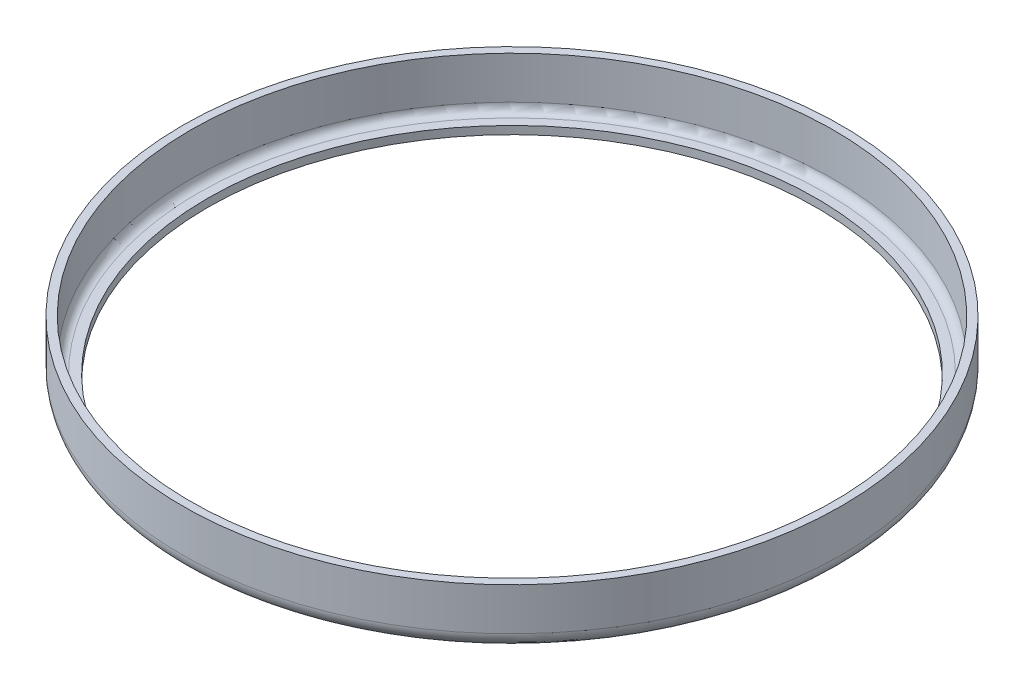
ISO-10303-21;
HEADER;
FILE_DESCRIPTION(('STEP AP214'),'2;1');
FILE_NAME('part.step','',(''),(''),'','','');
FILE_SCHEMA(('AUTOMOTIVE_DESIGN { 1 0 10303 214 1 1 1 1 }'));
ENDSEC;
DATA;
#1=APPLICATION_CONTEXT('core data for automotive mechanical design processes');
#2=APPLICATION_PROTOCOL_DEFINITION('international standard','automotive_design',2000,#1);
#3=PRODUCT_CONTEXT('',#1,'mechanical');
#4=PRODUCT('Part','Part','',(#3));
#5=PRODUCT_RELATED_PRODUCT_CATEGORY('part','',(#4));
#6=PRODUCT_DEFINITION_FORMATION('','',#4);
#7=PRODUCT_DEFINITION_CONTEXT('part definition',#1,'design');
#8=PRODUCT_DEFINITION('design','',#6,#7);
#9=PRODUCT_DEFINITION_SHAPE('','',#8);
#10=(LENGTH_UNIT() NAMED_UNIT(*) SI_UNIT(.MILLI.,.METRE.));
#11=(NAMED_UNIT(*) PLANE_ANGLE_UNIT() SI_UNIT($,.RADIAN.));
#12=(NAMED_UNIT(*) SI_UNIT($,.STERADIAN.) SOLID_ANGLE_UNIT());
#13=UNCERTAINTY_MEASURE_WITH_UNIT(LENGTH_MEASURE(1.E-05),#10,'distance_accuracy_value','');
#14=(GEOMETRIC_REPRESENTATION_CONTEXT(3) GLOBAL_UNCERTAINTY_ASSIGNED_CONTEXT((#13)) GLOBAL_UNIT_ASSIGNED_CONTEXT((#10,
#11,#12)) REPRESENTATION_CONTEXT('',''));
#15=CARTESIAN_POINT('',(0.,0.,0.));
#16=DIRECTION('',(0.,0.,1.));
#17=DIRECTION('',(1.,0.,0.));
#18=AXIS2_PLACEMENT_3D('',#15,#16,#17);
#19=CARTESIAN_POINT('',(0.,1.3,0.));
#20=DIRECTION('',(0.,1.,0.));
#21=DIRECTION('',(-1.,0.,0.));
#22=AXIS2_PLACEMENT_3D('',#19,#20,#21);
#23=PLANE('',#22);
#24=CARTESIAN_POINT('',(0.,1.3,0.));
#25=DIRECTION('',(0.,1.,0.));
#26=DIRECTION('',(-1.,0.,0.));
#27=AXIS2_PLACEMENT_3D('',#24,#25,#26);
#28=CIRCLE('',#27,49.5);
#29=CARTESIAN_POINT('',(-49.5,1.3,0.));
#30=VERTEX_POINT('',#29);
#31=EDGE_CURVE('E53',#30,#30,#28,.F.);
#32=ORIENTED_EDGE('',*,*,#31,.T.);
#33=EDGE_LOOP('',(#32));
#34=FACE_BOUND('',#33,.T.);
#35=CARTESIAN_POINT('',(0.,1.3,0.));
#36=DIRECTION('',(0.,-1.,0.));
#37=DIRECTION('',(-1.,0.,0.));
#38=AXIS2_PLACEMENT_3D('',#35,#36,#37);
#39=CIRCLE('',#38,51.);
#40=CARTESIAN_POINT('',(51.,1.3,0.));
#41=VERTEX_POINT('',#40);
#42=CARTESIAN_POINT('',(-51.,1.3,0.));
#43=VERTEX_POINT('',#42);
#44=EDGE_CURVE('E51',#41,#43,#39,.F.);
#45=ORIENTED_EDGE('',*,*,#44,.T.);
#46=CARTESIAN_POINT('',(51.,1.3,0.));
#47=CARTESIAN_POINT('',(51.0000048953473,1.30000000000007,0.380232623310823));
#48=CARTESIAN_POINT('',(50.995755911983,1.30000000001969,0.760465264724093));
#49=CARTESIAN_POINT('',(50.9787540292217,1.3000000000918,1.52081383077974));
#50=CARTESIAN_POINT('',(50.96599948816,1.30000000014428,1.90092971871491));
#51=CARTESIAN_POINT('',(50.9319870512731,1.30000000027584,2.66085438904016));
#52=CARTESIAN_POINT('',(50.9107275146425,1.30000000035492,3.04066309799282));
#53=CARTESIAN_POINT('',(50.8597110518025,1.30000000053392,3.79978301740181));
#54=CARTESIAN_POINT('',(50.8299524866894,1.30000000063384,4.17909411771625));
#55=CARTESIAN_POINT('',(50.7619478933905,1.30000000084911,4.93702848590818));
#56=CARTESIAN_POINT('',(50.7237002289656,1.30000000096446,5.31565160697719));
#57=CARTESIAN_POINT('',(50.6387317130363,1.30000000120557,6.07201984610875));
#58=CARTESIAN_POINT('',(50.5920092287945,1.30000000133133,6.44976478075419));
#59=CARTESIAN_POINT('',(50.4901095934652,1.30000000158865,7.20418673328524));
#60=CARTESIAN_POINT('',(50.4349308139578,1.3000000017202,7.58086353122108));
#61=CARTESIAN_POINT('',(50.3161413768466,1.30000000198485,8.33295964982566));
#62=CARTESIAN_POINT('',(50.2525290959601,1.30000000211794,8.70837871410645));
#63=CARTESIAN_POINT('',(50.1168997001863,1.30000000238181,9.45777025376751));
#64=CARTESIAN_POINT('',(50.0448809679699,1.30000000251259,9.83174243643444));
#65=CARTESIAN_POINT('',(49.8924699631129,1.30000000276836,10.5780516458877));
#66=CARTESIAN_POINT('',(49.8120760799114,1.30000000289336,10.9503883437665));
#67=CARTESIAN_POINT('',(49.6429503055862,1.30000000313447,11.6932386569306));
#68=CARTESIAN_POINT('',(49.5542168114815,1.30000000325059,12.0637519072637));
#69=CARTESIAN_POINT('',(49.3684515747464,1.30000000347125,12.8027681343629));
#70=CARTESIAN_POINT('',(49.2714182375233,1.3000000035758,13.1712707102996));
#71=CARTESIAN_POINT('',(49.0690972864767,1.300000003771,13.906079228634));
#72=CARTESIAN_POINT('',(48.9638080872537,1.30000000386166,14.272384734511));
#73=CARTESIAN_POINT('',(48.7450235801929,1.30000000402716,15.0026136787638));
#74=CARTESIAN_POINT('',(48.63152669695,1.300000004102,15.3665366451317));
#75=CARTESIAN_POINT('',(48.396379167268,1.30000000423432,16.0918160971199));
#76=CARTESIAN_POINT('',(48.2747269562148,1.3000000042918,16.4531720754671));
#77=CARTESIAN_POINT('',(48.0233252729979,1.30000000438824,17.1731342532365));
#78=CARTESIAN_POINT('',(47.8935742478029,1.30000000442721,17.5317399103605));
#79=CARTESIAN_POINT('',(47.6260355721526,1.30000000448584,18.24601935653));
#80=CARTESIAN_POINT('',(47.4882463810354,1.30000000450552,18.6016925685098));
#81=CARTESIAN_POINT('',(47.2046961181244,1.30000000452519,19.3099263377657));
#82=CARTESIAN_POINT('',(47.0589335188191,1.30000000452519,19.6624862834841));
#83=CARTESIAN_POINT('',(46.7595052656968,1.30000000450552,20.3643141291298));
#84=CARTESIAN_POINT('',(46.605838098294,1.30000000448584,20.7135813833005));
#85=CARTESIAN_POINT('',(46.2906735874604,1.3000000044272,21.4086459427637));
#86=CARTESIAN_POINT('',(46.129174745138,1.30000000438824,21.7544425684114));
#87=CARTESIAN_POINT('',(45.7984237839034,1.30000000429179,22.4423895476132));
#88=CARTESIAN_POINT('',(45.6291701815558,1.30000000423431,22.7845391879622));
#89=CARTESIAN_POINT('',(45.2829905872107,1.30000000410199,23.465017544452));
#90=CARTESIAN_POINT('',(45.1060631279886,1.30000000402714,23.8033455141727));
#91=CARTESIAN_POINT('',(44.7446206588051,1.30000000386164,24.476007638933));
#92=CARTESIAN_POINT('',(44.5601041985772,1.30000000377098,24.8103410146996));
#93=CARTESIAN_POINT('',(44.1835724806722,1.30000000357578,25.474842912528));
#94=CARTESIAN_POINT('',(43.991555790426,1.30000000347123,25.805010622843));
#95=CARTESIAN_POINT('',(43.6001162405039,1.30000000325057,26.4610120912074));
#96=CARTESIAN_POINT('',(43.400691966687,1.30000000313445,26.786845005432));
#97=CARTESIAN_POINT('',(42.9945337107304,1.30000000289333,27.4340098117407));
#98=CARTESIAN_POINT('',(42.7877983335999,1.30000000276834,27.7553408283345));
#99=CARTESIAN_POINT('',(42.3671181213991,1.30000000251257,28.3933368853933));
#100=CARTESIAN_POINT('',(42.1531719112014,1.30000000238179,28.7100010191311));
#101=CARTESIAN_POINT('',(41.7181740272876,1.30000000211792,29.3385005591991));
#102=CARTESIAN_POINT('',(41.497120999011,1.30000000198482,29.6503350280102));
#103=CARTESIAN_POINT('',(41.0480171680534,1.30000000172018,30.2690147734741));
#104=CARTESIAN_POINT('',(40.8199650320724,1.30000000158864,30.5758590822761));
#105=CARTESIAN_POINT('',(40.3569743261539,1.3000000013313,31.1844004199057));
#106=CARTESIAN_POINT('',(40.1220344448612,1.3000000012055,31.4860964510284));
#107=CARTESIAN_POINT('',(39.6453831651447,1.30000000096449,32.0841855833832));
#108=CARTESIAN_POINT('',(39.4036704779801,1.30000000084928,32.3805776575451));
#109=CARTESIAN_POINT('',(38.9135921135736,1.30000000063363,32.9679058297759));
#110=CARTESIAN_POINT('',(38.6652251708807,1.3000000005332,33.258840871929));
#111=CARTESIAN_POINT('',(38.1619600513174,1.30000000035562,33.8351043067912));
#112=CARTESIAN_POINT('',(37.9070606328874,1.30000000027848,34.1204316152143));
#113=CARTESIAN_POINT('',(37.3908567064004,1.30000000014162,34.6853325266122));
#114=CARTESIAN_POINT('',(37.1295509814981,1.30000000008191,34.9649050176437));
#115=CARTESIAN_POINT('',(36.6006603728143,1.30000000002958,35.5181485867249));
#116=CARTESIAN_POINT('',(36.3330742968432,1.30000000003698,35.7918185250694));
#117=CARTESIAN_POINT('',(35.792678960063,1.29999999996314,36.3322115838563));
#118=CARTESIAN_POINT('',(35.5198890399218,1.29999999988218,36.5989540465107));
#119=CARTESIAN_POINT('',(34.9684120981636,1.30000000047375,37.1262667336179));
#120=CARTESIAN_POINT('',(34.6897251338751,1.30000000114627,37.3868370180217));
#121=CARTESIAN_POINT('',(34.1265925188405,1.30000000828848,37.9016721321756));
#122=CARTESIAN_POINT('',(33.842146916405,1.30000001475813,38.1559370147833));
#123=CARTESIAN_POINT('',(33.2676336433653,1.3000000403726,38.6580368453349));
#124=CARTESIAN_POINT('',(32.9775660124357,1.30000005951733,38.9058718386257));
#125=CARTESIAN_POINT('',(32.5749711243778,1.3000001059059,39.2421372724497));
#126=CARTESIAN_POINT('',(32.4647878435351,1.30000012060955,39.3333857931299));
#127=CARTESIAN_POINT('',(32.1699487210445,1.30000016101675,39.5754656337379));
#128=CARTESIAN_POINT('',(31.9846107209607,1.30000018751909,39.7254674626692));
#129=CARTESIAN_POINT('',(31.5000063298855,1.30000023888953,40.1120409400474));
#130=CARTESIAN_POINT('',(31.1990983988414,1.30000025323814,40.3465591494784));
#131=CARTESIAN_POINT('',(30.592066473726,1.30000024176809,40.8087194195124));
#132=CARTESIAN_POINT('',(30.2859426424976,1.30000021595068,41.0363616941724));
#133=CARTESIAN_POINT('',(29.6686522730677,1.30000013805286,41.4846861110306));
#134=CARTESIAN_POINT('',(29.3574859112223,1.30000008597335,41.7053684958502));
#135=CARTESIAN_POINT('',(28.8086070691199,1.30000002406076,42.0852713355504));
#136=CARTESIAN_POINT('',(28.5719805079041,1.30000000692075,42.2460637359944));
#137=CARTESIAN_POINT('',(28.0815311708759,1.299999992653,42.5736224797916));
#138=CARTESIAN_POINT('',(27.8275468780452,1.29999999682283,42.7401468249868));
#139=CARTESIAN_POINT('',(27.1247071788344,1.3000000094836,43.1920099421992));
#140=CARTESIAN_POINT('',(26.6727992749554,1.30000001886741,43.472624457845));
#141=CARTESIAN_POINT('',(25.8373755655962,1.30000005827419,43.9734668032524));
#142=CARTESIAN_POINT('',(25.4551768835146,1.30000008455006,44.195898229002));
#143=CARTESIAN_POINT('',(24.7293748413681,1.30000012114485,44.6057025717932));
#144=CARTESIAN_POINT('',(24.3863872415922,1.30000013295126,44.794165677721));
#145=CARTESIAN_POINT('',(23.7468980640556,1.30000013816059,45.1359871689574));
#146=CARTESIAN_POINT('',(23.4509767310044,1.30000013401427,45.2904326752634));
#147=CARTESIAN_POINT('',(22.8136674692769,1.30000011905218,45.615117221889));
#148=CARTESIAN_POINT('',(22.4718228254377,1.30000010736834,45.7844610383661));
#149=CARTESIAN_POINT('',(21.7844149524757,1.30000007856829,46.1154084448778));
#150=CARTESIAN_POINT('',(21.4388517703319,1.30000006145215,46.2770121325592));
#151=CARTESIAN_POINT('',(20.7441857596195,1.30000002940441,46.5924207569242));
#152=CARTESIAN_POINT('',(20.3950829802787,1.30000001447277,46.7462258018912));
#153=CARTESIAN_POINT('',(19.8688903310319,1.30000000263213,46.9709678263064));
#154=CARTESIAN_POINT('',(19.6930692936616,1.30000000044473,47.0448877405375));
#155=CARTESIAN_POINT('',(19.4441896464366,1.2999999998166,47.14794611826));
#156=CARTESIAN_POINT('',(19.3714573778855,1.29999999992955,47.177874277735));
#157=CARTESIAN_POINT('',(18.9682018343392,1.3000000004758,47.3427343001128));
#158=CARTESIAN_POINT('',(18.636342986937,1.30000000062826,47.4744176352239));
#159=CARTESIAN_POINT('',(17.9298893857385,1.3000000112775,47.746186431155));
#160=CARTESIAN_POINT('',(17.5549509911742,1.30000002301506,47.8853801998617));
#161=CARTESIAN_POINT('',(17.0491026914815,1.3000000463518,48.0664377348183));
#162=CARTESIAN_POINT('',(16.9195800040398,1.30000005298326,48.1122084582486));
#163=CARTESIAN_POINT('',(16.4135202378357,1.30000007960458,48.288737128996));
#164=CARTESIAN_POINT('',(16.0356117392959,1.30000010101759,48.415600994342));
#165=CARTESIAN_POINT('',(15.3731091344217,1.30000012648927,48.6293594906958));
#166=CARTESIAN_POINT('',(15.0891492296108,1.30000013357149,48.7182327370458));
#167=CARTESIAN_POINT('',(14.3937588859858,1.3000001389228,48.9291855569175));
#168=CARTESIAN_POINT('',(13.9815044236233,1.30000013190771,49.0485641265525));
#169=CARTESIAN_POINT('',(13.2000828802515,1.30000011059789,49.2641649693778));
#170=CARTESIAN_POINT('',(12.8312181643637,1.30000009719868,49.3614863346895));
#171=CARTESIAN_POINT('',(12.0914026404646,1.30000006609533,49.5478203829288));
#172=CARTESIAN_POINT('',(11.7204518595016,1.30000004839125,49.6368331733246));
#173=CARTESIAN_POINT('',(10.8836498443703,1.30000001560988,49.8276350984469));
#174=CARTESIAN_POINT('',(10.4172547554729,1.3000000022954,49.9270561287467));
#175=CARTESIAN_POINT('',(9.80941312730236,1.29999999931187,50.047927127405));
#176=CARTESIAN_POINT('',(9.66910720238991,1.29999999961404,50.0752272813076));
#177=CARTESIAN_POINT('',(9.11257964542098,1.30000000119027,50.1811095335631));
#178=CARTESIAN_POINT('',(8.69547640814306,1.30000000320779,50.2551421365711));
#179=CARTESIAN_POINT('',(8.0120480497792,1.30000001931494,50.3676790460049));
#180=CARTESIAN_POINT('',(7.74622808779641,1.30000002873206,50.4092917286622));
#181=CARTESIAN_POINT('',(7.23985127965558,1.3000000509044,50.4844613212091));
#182=CARTESIAN_POINT('',(6.99935230387441,1.30000006324579,50.5184080994219));
#183=CARTESIAN_POINT('',(6.37902396432565,1.30000009473289,50.6014398619699));
#184=CARTESIAN_POINT('',(5.99884738598455,1.30000011369708,50.6479616662348));
#185=CARTESIAN_POINT('',(5.41181983914117,1.30000013093695,50.7130639471458));
#186=CARTESIAN_POINT('',(5.20530082658009,1.30000013470935,50.7346856589061));
#187=CARTESIAN_POINT('',(4.85629517127227,1.30000013648819,50.7690616518881));
#188=CARTESIAN_POINT('',(4.71387388834404,1.30000013592322,50.7824820960553));
#189=CARTESIAN_POINT('',(4.19146963898923,1.30000013159216,50.8294873092577));
#190=CARTESIAN_POINT('',(3.81114897425805,1.30000012406033,50.8594019566085));
#191=CARTESIAN_POINT('',(3.04994010328053,1.30000010132014,50.9106638980825));
#192=CARTESIAN_POINT('',(2.66905190389029,1.30000008611187,50.9320112948735));
#193=CARTESIAN_POINT('',(1.90689541399431,1.30000005333878,50.9661458217748));
#194=CARTESIAN_POINT('',(1.52562712859314,1.300000035774,50.9789330653377));
#195=CARTESIAN_POINT('',(0.76290569260361,1.30000001052997,50.9958810772168));
#196=CARTESIAN_POINT('',(0.381452544780571,1.30000000285057,51.0000419708178));
#197=CARTESIAN_POINT('',(-0.381507426537838,1.29999999714902,50.9999580231437));
#198=CARTESIAN_POINT('',(-0.76301424985967,1.29999999912825,50.9957119724014));
#199=CARTESIAN_POINT('',(-1.52583357765886,1.30000000122794,50.978647330571));
#200=CARTESIAN_POINT('',(-1.90714608398824,1.30000000134843,50.965828822776));
#201=CARTESIAN_POINT('',(-2.66938441111839,1.30000000808823,50.9316714338143));
#202=CARTESIAN_POINT('',(-3.0503102351347,1.30000001470749,50.9103326240917));
#203=CARTESIAN_POINT('',(-3.81159065259163,1.30000004042726,50.8591301196185));
#204=CARTESIAN_POINT('',(-4.19194525004263,1.30000005952769,50.8292664850013));
#205=CARTESIAN_POINT('',(-4.71439839531572,1.30000010590387,50.7823643103975));
#206=CARTESIAN_POINT('',(-4.85683218805472,1.3000001206091,50.7689754416163));
#207=CARTESIAN_POINT('',(-5.23649122711217,1.30000016101754,50.7316690320348));
#208=CARTESIAN_POINT('',(-5.4736122937344,1.30000018751756,50.7066825671865));
#209=CARTESIAN_POINT('',(-6.08962807102455,1.30000023888389,50.6373642184646));
#210=CARTESIAN_POINT('',(-6.46823152510104,1.30000025323188,50.5904196039376));
#211=CARTESIAN_POINT('',(-7.22426457588123,1.30000024176136,50.4879798795669));
#212=CARTESIAN_POINT('',(-7.60169420879789,1.3000002159441,50.4324850362257));
#213=CARTESIAN_POINT('',(-8.35519765050508,1.30000013804814,50.3130080646163));
#214=CARTESIAN_POINT('',(-8.73127150615117,1.30000008597035,50.2490262326027));
#215=CARTESIAN_POINT('',(-9.38801933299349,1.30000002405989,50.129542160623));
#216=CARTESIAN_POINT('',(-9.66903697668018,1.30000000692051,50.0759193141914));
#217=CARTESIAN_POINT('',(-10.2474564899152,1.29999999265325,49.9607381834231));
#218=CARTESIAN_POINT('',(-10.5448014491279,1.29999999682291,49.8988945628613));
#219=CARTESIAN_POINT('',(-11.361299635701,1.30000000948346,49.7214272966977));
#220=CARTESIAN_POINT('',(-11.8792707557527,1.30000001886738,49.6003046787091));
#221=CARTESIAN_POINT('',(-12.8241529428579,1.3000000582742,49.3637200783747));
#222=CARTESIAN_POINT('',(-13.2516908381993,1.30000008455003,49.2507476107567));
#223=CARTESIAN_POINT('',(-14.0546858157801,1.30000012114479,49.0273035022023));
#224=CARTESIAN_POINT('',(-14.4304783675745,1.30000013295119,48.9180381419079));
#225=CARTESIAN_POINT('',(-15.1243699488235,1.30000013816053,48.707555256026));
#226=CARTESIAN_POINT('',(-15.4428273950125,1.30000013401422,48.6075167395638));
#227=CARTESIAN_POINT('',(-16.1230597404833,1.30000011905214,48.3864576835459));
#228=CARTESIAN_POINT('',(-16.4845245673041,1.30000010736831,48.2644811787504));
#229=CARTESIAN_POINT('',(-17.2046104912091,1.30000007856827,48.0124255656776));
#230=CARTESIAN_POINT('',(-17.5632316241206,1.30000006145214,47.8823465596663));
#231=CARTESIAN_POINT('',(-18.2774622482221,1.30000002940441,47.6141710899442));
#232=CARTESIAN_POINT('',(-18.6330717811709,1.30000001447277,47.4760747376108));
#233=CARTESIAN_POINT('',(-19.1640627812346,1.30000000263214,47.2629169565533));
#234=CARTESIAN_POINT('',(-19.3406563016796,1.30000000044474,47.1908619813497));
#235=CARTESIAN_POINT('',(-19.5895140349317,1.29999999981661,47.0877507856151));
#236=CARTESIAN_POINT('',(-19.6621058890225,1.29999999992955,47.0574837227316));
#237=CARTESIAN_POINT('',(-20.0638242208941,1.3000000004758,46.888912649736));
#238=CARTESIAN_POINT('',(-20.3915980349488,1.30000000062826,46.7473671912659));
#239=CARTESIAN_POINT('',(-21.0833057564743,1.30000001127752,46.4399986060145));
#240=CARTESIAN_POINT('',(-21.4468521326732,1.30000002301508,46.273301965956));
#241=CARTESIAN_POINT('',(-21.9325679405314,1.30000004635184,46.0436401976113));
#242=CARTESIAN_POINT('',(-22.0565190974968,1.3000000529833,45.9844186171588));
#243=CARTESIAN_POINT('',(-22.5391820050258,1.30000007960464,45.7514049474702));
#244=CARTESIAN_POINT('',(-22.896109964064,1.30000010101765,45.5738895862778));
#245=CARTESIAN_POINT('',(-23.5157201334004,1.30000012648933,45.2565795830763));
#246=CARTESIAN_POINT('',(-23.7793529877517,1.30000013357156,45.1186324814475));
#247=CARTESIAN_POINT('',(-24.4202343896751,1.30000013892287,44.7760834207134));
#248=CARTESIAN_POINT('',(-24.7961557117663,1.30000013190777,44.5689888908886));
#249=CARTESIAN_POINT('',(-25.5011570021516,1.30000011059795,44.1688932365276));
#250=CARTESIAN_POINT('',(-25.830800341511,1.30000009719873,43.9768830919128));
#251=CARTESIAN_POINT('',(-26.4856869844567,1.30000006609536,43.585512587139));
#252=CARTESIAN_POINT('',(-26.8109303449085,1.30000004839127,43.3861523220975));
#253=CARTESIAN_POINT('',(-27.5375560595166,1.30000001560989,42.9293612776965));
#254=CARTESIAN_POINT('',(-27.937648474337,1.30000000229541,42.669871432265));
#255=CARTESIAN_POINT('',(-28.4529260906622,1.29999999931188,42.3255312136969));
#256=CARTESIAN_POINT('',(-28.5714414619949,1.29999999961404,42.245624082738));
#257=CARTESIAN_POINT('',(-29.0398359138803,1.30000000119027,41.92696974403));
#258=CARTESIAN_POINT('',(-29.3871214042335,1.3000000032078,41.6843821679153));
#259=CARTESIAN_POINT('',(-29.9499538663133,1.30000001931493,41.2807009368666));
#260=CARTESIAN_POINT('',(-30.1673415905092,1.30000002873204,41.1221624372916));
#261=CARTESIAN_POINT('',(-30.5785569548637,1.30000005090438,40.8172529205639));
#262=CARTESIAN_POINT('',(-30.7726193537714,1.30000006324578,40.6711985034725));
#263=CARTESIAN_POINT('',(-31.2699699935299,1.30000009473282,40.2912724956391));
#264=CARTESIAN_POINT('',(-31.5716913088228,1.30000011369691,40.0553429427825));
#265=CARTESIAN_POINT('',(-32.0328167915563,1.30000013093698,39.6862860139638));
#266=CARTESIAN_POINT('',(-32.1941367050649,1.30000013470952,39.5555438375388));
#267=CARTESIAN_POINT('',(-32.4652285192276,1.30000013648805,39.333067010071));
#268=CARTESIAN_POINT('',(-32.5754252557025,1.30000013592281,39.2418496310445));
#269=CARTESIAN_POINT('',(-32.9780585778138,1.30000013159331,38.9056918090265));
#270=CARTESIAN_POINT('',(-33.268138867948,1.30000012406755,38.6579175778895));
#271=CARTESIAN_POINT('',(-33.842642207358,1.30000010131307,38.1559087226388));
#272=CARTESIAN_POINT('',(-34.1270653243892,1.30000008608443,37.9016741759829));
#273=CARTESIAN_POINT('',(-34.6901291849631,1.30000005336636,37.3868870904465));
#274=CARTESIAN_POINT('',(-34.9687700050946,1.30000003587695,37.1263346353486));
#275=CARTESIAN_POINT('',(-35.5200755088975,1.30000001042709,36.5989850321125));
#276=CARTESIAN_POINT('',(-35.7927402793051,1.3000000024665,36.3321879747248));
#277=CARTESIAN_POINT('',(-36.2207340361127,1.29999999855244,35.9041361806057));
#278=CARTESIAN_POINT('',(-36.3780029530736,1.29999999899727,35.74481210981));
#279=CARTESIAN_POINT('',(-36.9610659560954,1.30000000419573,35.1463271796493));
#280=CARTESIAN_POINT('',(-37.3800893763417,1.30000001507848,34.7005091898937));
#281=CARTESIAN_POINT('',(-38.0222947630059,1.30000005463693,33.9921006023085));
#282=CARTESIAN_POINT('',(-38.2510682315714,1.30000007346354,33.7345415876916));
#283=CARTESIAN_POINT('',(-38.7183652848219,1.30000010846566,33.1975526903481));
#284=CARTESIAN_POINT('',(-38.956526817185,1.30000012438194,32.9178066319483));
#285=CARTESIAN_POINT('',(-39.2694703967744,1.30000013378755,32.5420291183434));
#286=CARTESIAN_POINT('',(-39.3469878039346,1.30000013515682,32.4482637417529));
#287=CARTESIAN_POINT('',(-39.5754188223143,1.30000013694971,32.1699227328958));
#288=CARTESIAN_POINT('',(-39.7253736584759,1.30000013520459,31.9845586944854));
#289=CARTESIAN_POINT('',(-40.1118477808137,1.3000001262757,31.4998995293351));
#290=CARTESIAN_POINT('',(-40.346325274073,1.30000011645709,31.1989729944137));
#291=CARTESIAN_POINT('',(-40.8084434526132,1.30000009034261,30.591924886674));
#292=CARTESIAN_POINT('',(-41.0360842219619,1.30000007404683,30.2858033778083));
#293=CARTESIAN_POINT('',(-41.484433886721,1.30000004101443,29.6685283072833));
#294=CARTESIAN_POINT('',(-41.7051428761638,1.30000002427782,29.3573748139718));
#295=CARTESIAN_POINT('',(-42.0851642009307,1.30000000611427,28.8085588944142));
#296=CARTESIAN_POINT('',(-42.2460312532258,1.30000000190593,28.5719710206106));
#297=CARTESIAN_POINT('',(-42.5835071270591,1.29999999785855,28.0667963261161));
#298=CARTESIAN_POINT('',(-42.7596047458352,1.29999999862369,27.7978680359876));
#299=CARTESIAN_POINT('',(-43.210713285303,1.3000000071578,27.094540860724));
#300=CARTESIAN_POINT('',(-43.4817446630987,1.30000001884995,26.6575792184254));
#301=CARTESIAN_POINT('',(-43.9734688018564,1.30000005890655,25.8373784364399));
#302=CARTESIAN_POINT('',(-44.1958983953822,1.300000084709,25.4551781851428));
#303=CARTESIAN_POINT('',(-44.6057017142079,1.30000012100417,24.7293749476863));
#304=CARTESIAN_POINT('',(-44.7941653752919,1.30000013291618,24.3863874385611));
#305=CARTESIAN_POINT('',(-45.1359872728906,1.30000013819052,23.746898184219));
#306=CARTESIAN_POINT('',(-45.2904327049349,1.30000013402282,23.4509767651304));
#307=CARTESIAN_POINT('',(-45.6151171883563,1.30000011904253,22.8136674301207));
#308=CARTESIAN_POINT('',(-45.7844610295935,1.30000010736581,22.4718228149029));
#309=CARTESIAN_POINT('',(-46.1154084541628,1.30000007857096,21.7844149628102));
#310=CARTESIAN_POINT('',(-46.2770121351422,1.3000000614529,21.4388517729149));
#311=CARTESIAN_POINT('',(-46.5924207548559,1.30000002940377,20.7441857567347));
#312=CARTESIAN_POINT('',(-46.7462258018737,1.30000001447267,20.3950829796775));
#313=CARTESIAN_POINT('',(-46.9709678265826,1.3000000026322,19.8688903310011));
#314=CARTESIAN_POINT('',(-47.0448877404475,1.30000000044475,19.6930692933461));
#315=CARTESIAN_POINT('',(-47.1479457512939,1.29999999981661,19.4441905328569));
#316=CARTESIAN_POINT('',(-47.177873547739,1.29999999992955,19.3714591526772));
#317=CARTESIAN_POINT('',(-47.3427331416879,1.3000000004758,18.9682047222426));
#318=CARTESIAN_POINT('',(-47.4744164106944,1.30000000062826,18.6363460990551));
#319=CARTESIAN_POINT('',(-47.7461855807067,1.30000001127703,17.9298916648964));
#320=CARTESIAN_POINT('',(-47.8853797599079,1.30000002301409,17.5549522016339));
#321=CARTESIAN_POINT('',(-48.0664375171161,1.30000004634974,17.0491032780804));
#322=CARTESIAN_POINT('',(-48.1122080814898,1.30000005298084,16.9195810457655));
#323=CARTESIAN_POINT('',(-48.2887364526684,1.30000007960071,16.4135221812664));
#324=CARTESIAN_POINT('',(-48.4156001841958,1.30000010101241,16.0356141315619));
#325=CARTESIAN_POINT('',(-48.629358859506,1.30000012648204,15.3731110945903));
#326=CARTESIAN_POINT('',(-48.7182323924386,1.30000013356344,15.0891503005991));
#327=CARTESIAN_POINT('',(-48.9291854881278,1.30000013891343,14.3937590482615));
#328=CARTESIAN_POINT('',(-49.0485640626765,1.30000013189819,13.9815045711801));
#329=CARTESIAN_POINT('',(-49.2641649156767,1.30000011058921,13.2000829997995));
#330=CARTESIAN_POINT('',(-49.3614862861534,1.30000009719085,12.8312182706014));
#331=CARTESIAN_POINT('',(-49.547820345583,1.30000006608974,12.0914027198315));
#332=CARTESIAN_POINT('',(-49.6368331419955,1.30000004838704,11.7204519253059));
#333=CARTESIAN_POINT('',(-49.8276350809466,1.30000001560848,10.883649879112));
#334=CARTESIAN_POINT('',(-49.9270561190819,1.30000000229532,10.4172547727191));
#335=CARTESIAN_POINT('',(-50.0479275869491,1.29999999931189,9.80941082539295));
#336=CARTESIAN_POINT('',(-50.0752281816601,1.29999999961399,9.66910259500314));
#337=CARTESIAN_POINT('',(-50.1811107016897,1.30000000119052,9.1125732696429));
#338=CARTESIAN_POINT('',(-50.2551431673457,1.30000000320951,8.69547057703612));
#339=CARTESIAN_POINT('',(-50.3676796782418,1.30000001932268,8.01204431266781));
#340=CARTESIAN_POINT('',(-50.4092921101333,1.30000002874299,7.746225901508));
#341=CARTESIAN_POINT('',(-50.484461772729,1.30000005092309,7.23984866650139));
#342=CARTESIAN_POINT('',(-50.5184088190379,1.30000006326895,6.99934770518854));
#343=CARTESIAN_POINT('',(-50.601440811161,1.30000009476749,6.37901720392426));
#344=CARTESIAN_POINT('',(-50.6479626066665,1.3000001137387,5.99884045293527));
#345=CARTESIAN_POINT('',(-50.7130645807715,1.30000013098866,5.41181481875195));
#346=CARTESIAN_POINT('',(-50.7346860448899,1.30000013476449,5.20529789417942));
#347=CARTESIAN_POINT('',(-50.7690618729467,1.30000013654447,4.85629435108983));
#348=CARTESIAN_POINT('',(-50.7824823524771,1.30000013597863,4.71387309019394));
#349=CARTESIAN_POINT('',(-50.8294873518435,1.30000013165787,4.19146892667609));
#350=CARTESIAN_POINT('',(-50.8594011777692,1.30000012415963,3.8111483317851));
#351=CARTESIAN_POINT('',(-50.9106650138483,1.30000010132775,3.04993956412208));
#352=CARTESIAN_POINT('',(-50.9320151266766,1.30000008599421,2.66905139820992));
#353=CARTESIAN_POINT('',(-50.9661422406714,1.30000005352666,1.90689511714832));
#354=CARTESIAN_POINT('',(-50.9789193555141,1.30000003639268,1.525627007104));
#355=CARTESIAN_POINT('',(-50.9958949248727,1.30000000993563,0.762905405563339));
#356=CARTESIAN_POINT('',(-51.0000935040358,1.30000000061245,0.381451916841134));
#357=CARTESIAN_POINT('',(-51.,1.3,0.));
#358=B_SPLINE_CURVE_WITH_KNOTS('',3,(#46,#47,#48,#49,#50,#51,#52,#53,#54,#55,#56,#57,#58,#59,
#60,#61,#62,#63,#64,#65,#66,#67,#68,#69,#70,#71,#72,#73,#74,#75,#76,#77,#78,#79,#80,#81,#82,#83,
#84,#85,#86,#87,#88,#89,#90,#91,#92,#93,#94,#95,#96,#97,#98,#99,#100,#101,#102,#103,#104,#105,
#106,#107,#108,#109,#110,#111,#112,#113,#114,#115,#116,#117,#118,#119,#120,#121,#122,#123,#124,
#125,#126,#127,#128,#129,#130,#131,#132,#133,#134,#135,#136,#137,#138,#139,#140,#141,#142,#143,
#144,#145,#146,#147,#148,#149,#150,#151,#152,#153,#154,#155,#156,#157,#158,#159,#160,#161,#162,
#163,#164,#165,#166,#167,#168,#169,#170,#171,#172,#173,#174,#175,#176,#177,#178,#179,#180,#181,
#182,#183,#184,#185,#186,#187,#188,#189,#190,#191,#192,#193,#194,#195,#196,#197,#198,#199,#200,
#201,#202,#203,#204,#205,#206,#207,#208,#209,#210,#211,#212,#213,#214,#215,#216,#217,#218,#219,
#220,#221,#222,#223,#224,#225,#226,#227,#228,#229,#230,#231,#232,#233,#234,#235,#236,#237,#238,
#239,#240,#241,#242,#243,#244,#245,#246,#247,#248,#249,#250,#251,#252,#253,#254,#255,#256,#257,
#258,#259,#260,#261,#262,#263,#264,#265,#266,#267,#268,#269,#270,#271,#272,#273,#274,#275,#276,
#277,#278,#279,#280,#281,#282,#283,#284,#285,#286,#287,#288,#289,#290,#291,#292,#293,#294,#295,
#296,#297,#298,#299,#300,#301,#302,#303,#304,#305,#306,#307,#308,#309,#310,#311,#312,#313,#314,
#315,#316,#317,#318,#319,#320,#321,#322,#323,#324,#325,#326,#327,#328,#329,#330,#331,#332,#333,
#334,#335,#336,#337,#338,#339,#340,#341,#342,#343,#344,#345,#346,#347,#348,#349,#350,#351,#352,
#353,#354,#355,#356,#357),.UNSPECIFIED.,.F.,.F.,(4,2,2,2,2,2,2,2,2,2,2,2,2,2,2,2,2,2,2,2,2,2,2,
2,2,2,2,2,2,2,2,2,2,2,2,2,2,2,2,2,2,2,2,2,2,2,2,2,2,2,2,2,2,2,2,2,2,2,2,2,2,2,2,2,2,2,2,2,2,2,2,
2,2,2,2,2,2,2,2,2,2,2,2,2,2,2,2,2,2,2,2,2,2,2,2,2,2,2,2,2,2,2,2,2,2,2,2,2,2,2,2,2,2,2,2,2,2,2,2,
2,2,2,2,2,2,2,2,2,2,2,2,2,2,2,2,2,2,2,2,2,2,2,2,2,2,2,2,2,2,2,2,2,2,2,2,4),(0.,1.14067404651069,
2.28156831920598,3.42268280233654,4.56401748014382,5.70557233686015,6.84734735670873,
7.98934252390346,9.13155782264928,10.2739932371418,11.4166487515674,12.5595243501036,
13.7026200169185,14.8459357361711,15.9894714920112,17.1332272685795,18.2772030500075,
19.4213988204176,20.5658145639229,21.7104502646275,22.8553059066263,24.0003814740048,
25.1456769508396,26.2911923211982,27.4369275691386,28.5828826787099,29.729057633952,
30.8754524188956,32.0220670175622,33.1689014139642,34.3159555921047,35.463229535978,
36.6107232295687,37.7584366568527,38.9063698017965,40.0545226483574,41.1990202240626,
42.34350667856,43.4879835356603,44.6324523191252,45.0616340406512,45.7769124288941,
46.9213170598283,48.0656860271507,49.2100150576607,50.0682410460147,50.9793248609743,
52.5748684148476,53.9013631496901,55.075320547101,56.0766614883748,57.2210332470182,
58.3653905648644,59.509731989052,60.081905334923,60.3178522536398,61.3888611944513,
62.5885621780142,63.0006769654833,64.1964464363139,65.0890378698797,66.3764608656461,
67.5208291503015,68.6651826309398,70.0955844853566,70.5243954874353,71.7951035041373,
72.6022463329701,73.3308731729959,74.4797981785861,75.1027276098169,75.5318805384709,
76.6762589728478,77.8206236928752,78.9649732456683,80.1093061783879,81.2538037528254,
82.398290207043,83.542767064745,84.6872358495864,85.1164175718095,85.831695958927,
86.9761005886444,88.1204695555531,89.2647985865568,90.1230245759364,91.0341097717077,
92.6296519442329,93.9561461997198,95.1301040762822,96.1314450177247,97.2758167765631,
98.420174094607,99.5645155189945,100.136688864966,100.372635683704,101.443644602038,
102.64334570741,103.055460486351,104.251229948918,105.143821399038,106.431244395015,
107.575612679851,108.719966160662,110.150368015286,110.579178931854,111.849886973513,
112.657029863207,113.385656495524,114.53458148696,115.157511140164,115.586664068785,
116.731042503065,117.875407222985,119.019756775656,120.16408970824,120.835690227894,
122.670690467008,123.704110968792,124.806190995559,125.171166178596,125.886416336003,
127.03079147804,128.175152542503,129.319498076518,130.177754078143,131.142066436051,
132.684385560125,134.0108791451,135.18483769235,136.186178633687,137.330550392392,
138.474907710285,139.619249134503,140.191422480383,140.42736652009,141.498374762691,
142.698079179336,143.110192520487,144.305960587581,145.198554823281,146.485977865656,
147.630346192891,148.774699717281,150.205101628171,150.633919671809,151.904626008543,
152.711764124907,153.440396975529,154.589322486869,155.212245617146,155.641398478054,
156.78577672746,157.930141255898,159.074490609999,160.218823336441),.UNSPECIFIED.);
#359=EDGE_CURVE('E46',#43,#41,#358,.F.);
#360=ORIENTED_EDGE('',*,*,#359,.T.);
#361=EDGE_LOOP('',(#45,#360));
#362=FACE_BOUND('',#361,.T.);
#363=ADVANCED_FACE('F17',(#34,#362),#23,.T.);
#364=CARTESIAN_POINT('',(0.,-0.475,0.));
#365=DIRECTION('',(0.,1.,0.));
#366=DIRECTION('',(-1.,0.,0.));
#367=AXIS2_PLACEMENT_3D('',#364,#365,#366);
#368=CYLINDRICAL_SURFACE('',#367,49.5);
#369=ORIENTED_EDGE('',*,*,#31,.F.);
#370=EDGE_LOOP('',(#369));
#371=FACE_BOUND('',#370,.T.);
#372=CARTESIAN_POINT('',(0.,0.,0.));
#373=DIRECTION('',(0.,1.,0.));
#374=DIRECTION('',(-1.,0.,0.));
#375=AXIS2_PLACEMENT_3D('',#372,#373,#374);
#376=CIRCLE('',#375,49.5);
#377=CARTESIAN_POINT('',(-49.5,0.,0.));
#378=VERTEX_POINT('',#377);
#379=EDGE_CURVE('E56',#378,#378,#376,.F.);
#380=ORIENTED_EDGE('',*,*,#379,.T.);
#381=EDGE_LOOP('',(#380));
#382=FACE_BOUND('',#381,.T.);
#383=ADVANCED_FACE('F89',(#371,#382),#368,.F.);
#384=CARTESIAN_POINT('',(0.,2.6,0.));
#385=DIRECTION('',(0.,1.,0.));
#386=DIRECTION('',(0.,0.,1.));
#387=AXIS2_PLACEMENT_3D('',#384,#385,#386);
#388=TOROIDAL_SURFACE('',#387,51.,1.3);
#389=CARTESIAN_POINT('',(0.,2.6,0.));
#390=DIRECTION('',(0.,1.,0.));
#391=DIRECTION('',(-1.,0.,0.));
#392=AXIS2_PLACEMENT_3D('',#389,#390,#391);
#393=CIRCLE('',#392,52.3);
#394=CARTESIAN_POINT('',(-52.3,2.60000000000001,0.));
#395=VERTEX_POINT('',#394);
#396=EDGE_CURVE('E59',#395,#395,#393,.T.);
#397=ORIENTED_EDGE('',*,*,#396,.T.);
#398=EDGE_LOOP('',(#397));
#399=FACE_BOUND('',#398,.T.);
#400=ORIENTED_EDGE('',*,*,#44,.F.);
#401=ORIENTED_EDGE('',*,*,#359,.F.);
#402=EDGE_LOOP('',(#400,#401));
#403=FACE_BOUND('',#402,.T.);
#404=ADVANCED_FACE('F50',(#399,#403),#388,.F.);
#405=CARTESIAN_POINT('',(0.,0.,0.));
#406=DIRECTION('',(0.,1.,0.));
#407=DIRECTION('',(-1.,0.,0.));
#408=AXIS2_PLACEMENT_3D('',#405,#406,#407);
#409=PLANE('',#408);
#410=ORIENTED_EDGE('',*,*,#379,.F.);
#411=EDGE_LOOP('',(#410));
#412=FACE_BOUND('',#411,.T.);
#413=CARTESIAN_POINT('',(0.,0.,0.));
#414=DIRECTION('',(0.,1.,0.));
#415=DIRECTION('',(1.,0.,0.));
#416=AXIS2_PLACEMENT_3D('',#413,#414,#415);
#417=CIRCLE('',#416,51.);
#418=CARTESIAN_POINT('',(51.,0.,0.));
#419=VERTEX_POINT('',#418);
#420=CARTESIAN_POINT('',(-51.,0.,0.));
#421=VERTEX_POINT('',#420);
#422=EDGE_CURVE('E37',#419,#421,#417,.T.);
#423=ORIENTED_EDGE('',*,*,#422,.F.);
#424=CARTESIAN_POINT('',(0.,0.,0.));
#425=DIRECTION('',(0.,1.,0.));
#426=DIRECTION('',(-1.,0.,0.));
#427=AXIS2_PLACEMENT_3D('',#424,#425,#426);
#428=CIRCLE('',#427,51.);
#429=EDGE_CURVE('E127',#421,#419,#428,.T.);
#430=ORIENTED_EDGE('',*,*,#429,.F.);
#431=EDGE_LOOP('',(#423,#430));
#432=FACE_BOUND('',#431,.T.);
#433=ADVANCED_FACE('F88',(#412,#432),#409,.F.);
#434=CARTESIAN_POINT('',(0.,-0.475,0.));
#435=DIRECTION('',(0.,1.,0.));
#436=DIRECTION('',(-1.,0.,0.));
#437=AXIS2_PLACEMENT_3D('',#434,#435,#436);
#438=CYLINDRICAL_SURFACE('',#437,52.3);
#439=CARTESIAN_POINT('',(0.,9.5,0.));
#440=DIRECTION('',(0.,1.,0.));
#441=DIRECTION('',(-1.,0.,0.));
#442=AXIS2_PLACEMENT_3D('',#439,#440,#441);
#443=CIRCLE('',#442,52.3);
#444=CARTESIAN_POINT('',(-52.3,9.5,0.));
#445=VERTEX_POINT('',#444);
#446=EDGE_CURVE('E136',#445,#445,#443,.F.);
#447=ORIENTED_EDGE('',*,*,#446,.F.);
#448=EDGE_LOOP('',(#447));
#449=FACE_BOUND('',#448,.T.);
#450=ORIENTED_EDGE('',*,*,#396,.F.);
#451=EDGE_LOOP('',(#450));
#452=FACE_BOUND('',#451,.T.);
#453=ADVANCED_FACE('F112',(#449,#452),#438,.F.);
#454=CARTESIAN_POINT('',(0.,2.6,0.));
#455=DIRECTION('',(0.,1.,0.));
#456=DIRECTION('',(0.,0.,-1.));
#457=AXIS2_PLACEMENT_3D('',#454,#455,#456);
#458=TOROIDAL_SURFACE('',#457,51.,2.6);
#459=CARTESIAN_POINT('',(0.,2.6,0.));
#460=DIRECTION('',(0.,1.,0.));
#461=DIRECTION('',(-1.,0.,0.));
#462=AXIS2_PLACEMENT_3D('',#459,#460,#461);
#463=CIRCLE('',#462,53.6);
#464=CARTESIAN_POINT('',(-53.6,2.6,0.));
#465=VERTEX_POINT('',#464);
#466=EDGE_CURVE('E29',#465,#465,#463,.T.);
#467=ORIENTED_EDGE('',*,*,#466,.F.);
#468=EDGE_LOOP('',(#467));
#469=FACE_BOUND('',#468,.T.);
#470=ORIENTED_EDGE('',*,*,#429,.T.);
#471=ORIENTED_EDGE('',*,*,#422,.T.);
#472=EDGE_LOOP('',(#470,#471));
#473=FACE_BOUND('',#472,.T.);
#474=ADVANCED_FACE('F101',(#469,#473),#458,.T.);
#475=CARTESIAN_POINT('',(0.,9.5,0.));
#476=DIRECTION('',(0.,1.,0.));
#477=DIRECTION('',(-1.,0.,0.));
#478=AXIS2_PLACEMENT_3D('',#475,#476,#477);
#479=PLANE('',#478);
#480=ORIENTED_EDGE('',*,*,#446,.T.);
#481=EDGE_LOOP('',(#480));
#482=FACE_BOUND('',#481,.T.);
#483=CARTESIAN_POINT('',(0.,9.5,0.));
#484=DIRECTION('',(0.,1.,0.));
#485=DIRECTION('',(-1.,0.,0.));
#486=AXIS2_PLACEMENT_3D('',#483,#484,#485);
#487=CIRCLE('',#486,53.6);
#488=CARTESIAN_POINT('',(-53.6,9.50000000000001,0.));
#489=VERTEX_POINT('',#488);
#490=EDGE_CURVE('E11',#489,#489,#487,.F.);
#491=ORIENTED_EDGE('',*,*,#490,.F.);
#492=EDGE_LOOP('',(#491));
#493=FACE_BOUND('',#492,.T.);
#494=ADVANCED_FACE('F111',(#482,#493),#479,.T.);
#495=CARTESIAN_POINT('',(0.,-0.475,0.));
#496=DIRECTION('',(0.,1.,0.));
#497=DIRECTION('',(-1.,0.,0.));
#498=AXIS2_PLACEMENT_3D('',#495,#496,#497);
#499=CYLINDRICAL_SURFACE('',#498,53.6);
#500=ORIENTED_EDGE('',*,*,#490,.T.);
#501=EDGE_LOOP('',(#500));
#502=FACE_BOUND('',#501,.T.);
#503=ORIENTED_EDGE('',*,*,#466,.T.);
#504=EDGE_LOOP('',(#503));
#505=FACE_BOUND('',#504,.T.);
#506=ADVANCED_FACE('F155',(#502,#505),#499,.T.);
#507=CLOSED_SHELL('',(#363,#383,#404,#433,#453,#474,#494,#506));
#508=MANIFOLD_SOLID_BREP('B1',#507);
#509=ADVANCED_BREP_SHAPE_REPRESENTATION('',(#18,#508),#14);
#510=SHAPE_DEFINITION_REPRESENTATION(#9,#509);
ENDSEC;
END-ISO-10303-21;
